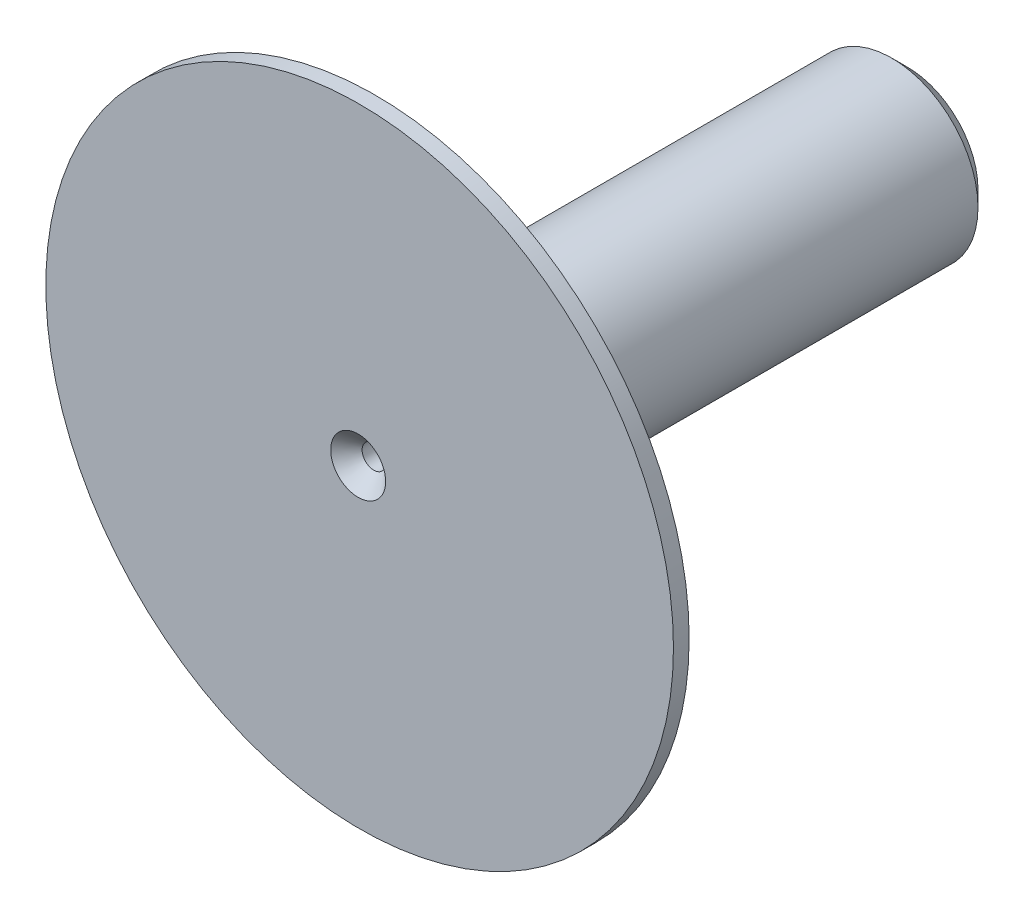
ISO-10303-21;
HEADER;
FILE_DESCRIPTION(('STEP AP214'),'2;1');
FILE_NAME('part.step','',(''),(''),'','','');
FILE_SCHEMA(('AUTOMOTIVE_DESIGN { 1 0 10303 214 1 1 1 1 }'));
ENDSEC;
DATA;
#1=APPLICATION_CONTEXT('core data for automotive mechanical design processes');
#2=APPLICATION_PROTOCOL_DEFINITION('international standard','automotive_design',2000,#1);
#3=PRODUCT_CONTEXT('',#1,'mechanical');
#4=PRODUCT('Part','Part','',(#3));
#5=PRODUCT_RELATED_PRODUCT_CATEGORY('part','',(#4));
#6=PRODUCT_DEFINITION_FORMATION('','',#4);
#7=PRODUCT_DEFINITION_CONTEXT('part definition',#1,'design');
#8=PRODUCT_DEFINITION('design','',#6,#7);
#9=PRODUCT_DEFINITION_SHAPE('','',#8);
#10=(LENGTH_UNIT() NAMED_UNIT(*) SI_UNIT(.MILLI.,.METRE.));
#11=(NAMED_UNIT(*) PLANE_ANGLE_UNIT() SI_UNIT($,.RADIAN.));
#12=(NAMED_UNIT(*) SI_UNIT($,.STERADIAN.) SOLID_ANGLE_UNIT());
#13=UNCERTAINTY_MEASURE_WITH_UNIT(LENGTH_MEASURE(1.E-05),#10,'distance_accuracy_value','');
#14=(GEOMETRIC_REPRESENTATION_CONTEXT(3) GLOBAL_UNCERTAINTY_ASSIGNED_CONTEXT((#13)) GLOBAL_UNIT_ASSIGNED_CONTEXT((#10,
#11,#12)) REPRESENTATION_CONTEXT('',''));
#15=CARTESIAN_POINT('',(0.,0.,0.));
#16=DIRECTION('',(0.,0.,1.));
#17=DIRECTION('',(1.,0.,0.));
#18=AXIS2_PLACEMENT_3D('',#15,#16,#17);
#19=CARTESIAN_POINT('',(0.,0.,7.));
#20=DIRECTION('',(0.,0.,-1.));
#21=DIRECTION('',(-1.,0.,0.));
#22=AXIS2_PLACEMENT_3D('',#19,#20,#21);
#23=CYLINDRICAL_SURFACE('',#22,1.1);
#24=CARTESIAN_POINT('',(0.,0.,0.2));
#25=DIRECTION('',(0.,0.,1.));
#26=DIRECTION('',(1.,0.,0.));
#27=AXIS2_PLACEMENT_3D('',#24,#25,#26);
#28=CIRCLE('',#27,1.1);
#29=CARTESIAN_POINT('',(1.1,0.,0.2));
#30=VERTEX_POINT('',#29);
#31=EDGE_CURVE('E65',#30,#30,#28,.T.);
#32=ORIENTED_EDGE('',*,*,#31,.T.);
#33=EDGE_LOOP('',(#32));
#34=FACE_BOUND('',#33,.T.);
#35=CARTESIAN_POINT('',(0.,0.,6.8));
#36=DIRECTION('',(0.,0.,1.));
#37=DIRECTION('',(1.,0.,0.));
#38=AXIS2_PLACEMENT_3D('',#35,#36,#37);
#39=CIRCLE('',#38,1.1);
#40=CARTESIAN_POINT('',(1.1,0.,6.8));
#41=VERTEX_POINT('',#40);
#42=EDGE_CURVE('E68',#41,#41,#39,.T.);
#43=ORIENTED_EDGE('',*,*,#42,.F.);
#44=EDGE_LOOP('',(#43));
#45=FACE_BOUND('',#44,.T.);
#46=ADVANCED_FACE('F41',(#34,#45),#23,.T.);
#47=CARTESIAN_POINT('',(0.,0.,7.));
#48=DIRECTION('',(0.,0.,1.));
#49=DIRECTION('',(1.,0.,0.));
#50=AXIS2_PLACEMENT_3D('',#47,#48,#49);
#51=PLANE('',#50);
#52=CARTESIAN_POINT('',(0.,0.,7.));
#53=DIRECTION('',(0.,0.,1.));
#54=DIRECTION('',(1.,0.,0.));
#55=AXIS2_PLACEMENT_3D('',#52,#53,#54);
#56=CIRCLE('',#55,0.350000000000001);
#57=CARTESIAN_POINT('',(0.350000000000001,0.,7.));
#58=VERTEX_POINT('',#57);
#59=EDGE_CURVE('E10',#58,#58,#56,.F.);
#60=ORIENTED_EDGE('',*,*,#59,.T.);
#61=EDGE_LOOP('',(#60));
#62=FACE_BOUND('',#61,.T.);
#63=CARTESIAN_POINT('',(0.0186698824009481,0.,7.));
#64=DIRECTION('',(0.,0.,1.));
#65=DIRECTION('',(1.,0.,0.));
#66=AXIS2_PLACEMENT_3D('',#63,#64,#65);
#67=CIRCLE('',#66,4.);
#68=CARTESIAN_POINT('',(4.01866988240095,0.,7.));
#69=VERTEX_POINT('',#68);
#70=EDGE_CURVE('E72',#69,#69,#67,.T.);
#71=ORIENTED_EDGE('',*,*,#70,.T.);
#72=EDGE_LOOP('',(#71));
#73=FACE_BOUND('',#72,.T.);
#74=ADVANCED_FACE('F96',(#62,#73),#51,.T.);
#75=CARTESIAN_POINT('',(0.,0.,0.));
#76=DIRECTION('',(0.,0.,1.));
#77=DIRECTION('',(1.,0.,0.));
#78=AXIS2_PLACEMENT_3D('',#75,#76,#77);
#79=PLANE('',#78);
#80=CARTESIAN_POINT('',(0.,0.,0.));
#81=DIRECTION('',(0.,0.,1.));
#82=DIRECTION('',(1.,0.,0.));
#83=AXIS2_PLACEMENT_3D('',#80,#81,#82);
#84=CIRCLE('',#83,0.899999999999998);
#85=CARTESIAN_POINT('',(0.899999999999998,0.,0.));
#86=VERTEX_POINT('',#85);
#87=EDGE_CURVE('E57',#86,#86,#84,.F.);
#88=ORIENTED_EDGE('',*,*,#87,.T.);
#89=EDGE_LOOP('',(#88));
#90=FACE_BOUND('',#89,.T.);
#91=CARTESIAN_POINT('',(0.,0.,0.));
#92=DIRECTION('',(0.,0.,1.));
#93=DIRECTION('',(1.,0.,0.));
#94=AXIS2_PLACEMENT_3D('',#91,#92,#93);
#95=CIRCLE('',#94,0.350000000000001);
#96=CARTESIAN_POINT('',(0.350000000000001,0.,0.));
#97=VERTEX_POINT('',#96);
#98=EDGE_CURVE('E62',#97,#97,#95,.T.);
#99=ORIENTED_EDGE('',*,*,#98,.T.);
#100=EDGE_LOOP('',(#99));
#101=FACE_BOUND('',#100,.T.);
#102=ADVANCED_FACE('F102',(#90,#101),#79,.F.);
#103=CARTESIAN_POINT('',(0.,0.,7.));
#104=DIRECTION('',(0.,0.,-1.));
#105=DIRECTION('',(-1.,0.,0.));
#106=AXIS2_PLACEMENT_3D('',#103,#104,#105);
#107=CYLINDRICAL_SURFACE('',#106,0.15);
#108=CARTESIAN_POINT('',(0.,0.,0.200000000000001));
#109=DIRECTION('',(0.,0.,1.));
#110=DIRECTION('',(1.,0.,0.));
#111=AXIS2_PLACEMENT_3D('',#108,#109,#110);
#112=CIRCLE('',#111,0.15);
#113=CARTESIAN_POINT('',(0.15,0.,0.200000000000001));
#114=VERTEX_POINT('',#113);
#115=EDGE_CURVE('E49',#114,#114,#112,.F.);
#116=ORIENTED_EDGE('',*,*,#115,.T.);
#117=EDGE_LOOP('',(#116));
#118=FACE_BOUND('',#117,.T.);
#119=CARTESIAN_POINT('',(0.,0.,6.8));
#120=DIRECTION('',(0.,0.,1.));
#121=DIRECTION('',(1.,0.,0.));
#122=AXIS2_PLACEMENT_3D('',#119,#120,#121);
#123=CIRCLE('',#122,0.15);
#124=CARTESIAN_POINT('',(0.15,0.,6.8));
#125=VERTEX_POINT('',#124);
#126=EDGE_CURVE('E53',#125,#125,#123,.T.);
#127=ORIENTED_EDGE('',*,*,#126,.T.);
#128=EDGE_LOOP('',(#127));
#129=FACE_BOUND('',#128,.T.);
#130=ADVANCED_FACE('F94',(#118,#129),#107,.F.);
#131=CARTESIAN_POINT('',(0.0186698824009481,0.,6.8));
#132=DIRECTION('',(0.,0.,1.));
#133=DIRECTION('',(1.,0.,0.));
#134=AXIS2_PLACEMENT_3D('',#131,#132,#133);
#135=CYLINDRICAL_SURFACE('',#134,4.);
#136=CARTESIAN_POINT('',(0.0186698824009481,0.,6.8));
#137=DIRECTION('',(0.,0.,1.));
#138=DIRECTION('',(1.,0.,0.));
#139=AXIS2_PLACEMENT_3D('',#136,#137,#138);
#140=CIRCLE('',#139,4.);
#141=CARTESIAN_POINT('',(4.01866988240095,0.,6.8));
#142=VERTEX_POINT('',#141);
#143=EDGE_CURVE('E71',#142,#142,#140,.T.);
#144=ORIENTED_EDGE('',*,*,#143,.T.);
#145=EDGE_LOOP('',(#144));
#146=FACE_BOUND('',#145,.T.);
#147=ORIENTED_EDGE('',*,*,#70,.F.);
#148=EDGE_LOOP('',(#147));
#149=FACE_BOUND('',#148,.T.);
#150=ADVANCED_FACE('F78',(#146,#149),#135,.T.);
#151=CARTESIAN_POINT('',(0.0186698824009481,0.,6.8));
#152=DIRECTION('',(0.,0.,1.));
#153=DIRECTION('',(1.,0.,0.));
#154=AXIS2_PLACEMENT_3D('',#151,#152,#153);
#155=PLANE('',#154);
#156=ORIENTED_EDGE('',*,*,#42,.T.);
#157=EDGE_LOOP('',(#156));
#158=FACE_BOUND('',#157,.T.);
#159=ORIENTED_EDGE('',*,*,#143,.F.);
#160=EDGE_LOOP('',(#159));
#161=FACE_BOUND('',#160,.T.);
#162=ADVANCED_FACE('F81',(#158,#161),#155,.F.);
#163=CARTESIAN_POINT('',(0.,0.,0.2));
#164=DIRECTION('',(0.,0.,1.));
#165=DIRECTION('',(1.,0.,0.));
#166=AXIS2_PLACEMENT_3D('',#163,#164,#165);
#167=CONICAL_SURFACE('',#166,1.1,0.785398163397454);
#168=ORIENTED_EDGE('',*,*,#87,.F.);
#169=EDGE_LOOP('',(#168));
#170=FACE_BOUND('',#169,.T.);
#171=ORIENTED_EDGE('',*,*,#31,.F.);
#172=EDGE_LOOP('',(#171));
#173=FACE_BOUND('',#172,.T.);
#174=ADVANCED_FACE('F83',(#170,#173),#167,.T.);
#175=CARTESIAN_POINT('',(0.,0.,0.));
#176=DIRECTION('',(0.,0.,-1.));
#177=DIRECTION('',(-1.,0.,0.));
#178=AXIS2_PLACEMENT_3D('',#175,#176,#177);
#179=CONICAL_SURFACE('',#178,0.350000000000001,0.78539816339745);
#180=ORIENTED_EDGE('',*,*,#115,.F.);
#181=EDGE_LOOP('',(#180));
#182=FACE_BOUND('',#181,.T.);
#183=ORIENTED_EDGE('',*,*,#98,.F.);
#184=EDGE_LOOP('',(#183));
#185=FACE_BOUND('',#184,.T.);
#186=ADVANCED_FACE('F91',(#182,#185),#179,.F.);
#187=CARTESIAN_POINT('',(0.,0.,6.8));
#188=DIRECTION('',(0.,0.,1.));
#189=DIRECTION('',(1.,0.,0.));
#190=AXIS2_PLACEMENT_3D('',#187,#188,#189);
#191=CONICAL_SURFACE('',#190,0.15,0.78539816339745);
#192=ORIENTED_EDGE('',*,*,#59,.F.);
#193=EDGE_LOOP('',(#192));
#194=FACE_BOUND('',#193,.T.);
#195=ORIENTED_EDGE('',*,*,#126,.F.);
#196=EDGE_LOOP('',(#195));
#197=FACE_BOUND('',#196,.T.);
#198=ADVANCED_FACE('F44',(#194,#197),#191,.F.);
#199=CLOSED_SHELL('',(#46,#74,#102,#130,#150,#162,#174,#186,#198));
#200=MANIFOLD_SOLID_BREP('B2',#199);
#201=ADVANCED_BREP_SHAPE_REPRESENTATION('',(#18,#200),#14);
#202=SHAPE_DEFINITION_REPRESENTATION(#9,#201);
ENDSEC;
END-ISO-10303-21;
